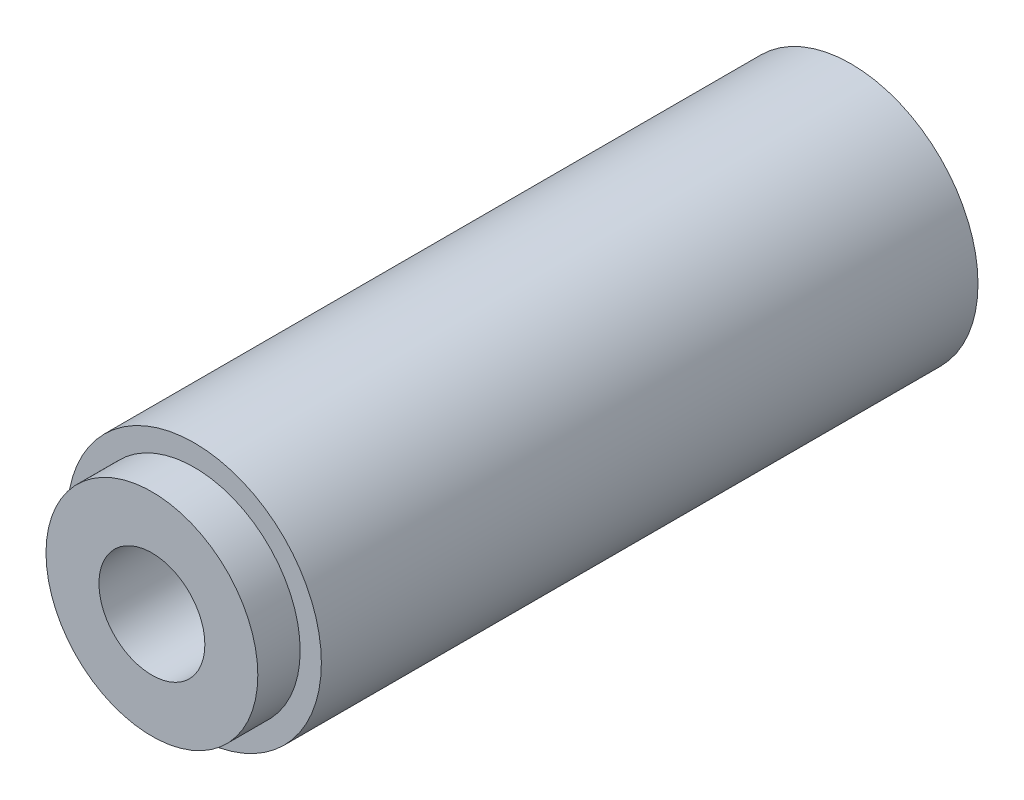
ISO-10303-21;
HEADER;
FILE_DESCRIPTION(('STEP AP214'),'2;1');
FILE_NAME('part.step','',(''),(''),'','','');
FILE_SCHEMA(('AUTOMOTIVE_DESIGN { 1 0 10303 214 1 1 1 1 }'));
ENDSEC;
DATA;
#1=APPLICATION_CONTEXT('core data for automotive mechanical design processes');
#2=APPLICATION_PROTOCOL_DEFINITION('international standard','automotive_design',2000,#1);
#3=PRODUCT_CONTEXT('',#1,'mechanical');
#4=PRODUCT('Part','Part','',(#3));
#5=PRODUCT_RELATED_PRODUCT_CATEGORY('part','',(#4));
#6=PRODUCT_DEFINITION_FORMATION('','',#4);
#7=PRODUCT_DEFINITION_CONTEXT('part definition',#1,'design');
#8=PRODUCT_DEFINITION('design','',#6,#7);
#9=PRODUCT_DEFINITION_SHAPE('','',#8);
#10=(LENGTH_UNIT() NAMED_UNIT(*) SI_UNIT(.MILLI.,.METRE.));
#11=(NAMED_UNIT(*) PLANE_ANGLE_UNIT() SI_UNIT($,.RADIAN.));
#12=(NAMED_UNIT(*) SI_UNIT($,.STERADIAN.) SOLID_ANGLE_UNIT());
#13=UNCERTAINTY_MEASURE_WITH_UNIT(LENGTH_MEASURE(1.E-05),#10,'distance_accuracy_value','');
#14=(GEOMETRIC_REPRESENTATION_CONTEXT(3) GLOBAL_UNCERTAINTY_ASSIGNED_CONTEXT((#13)) GLOBAL_UNIT_ASSIGNED_CONTEXT((#10,
#11,#12)) REPRESENTATION_CONTEXT('',''));
#15=CARTESIAN_POINT('',(0.,0.,0.));
#16=DIRECTION('',(0.,0.,1.));
#17=DIRECTION('',(1.,0.,0.));
#18=AXIS2_PLACEMENT_3D('',#15,#16,#17);
#19=CARTESIAN_POINT('',(0.,0.,31.));
#20=DIRECTION('',(0.,0.,1.));
#21=DIRECTION('',(1.,0.,0.));
#22=AXIS2_PLACEMENT_3D('',#19,#20,#21);
#23=PLANE('',#22);
#24=CARTESIAN_POINT('',(0.,0.,31.));
#25=DIRECTION('',(0.,0.,1.));
#26=DIRECTION('',(1.,0.,0.));
#27=AXIS2_PLACEMENT_3D('',#24,#25,#26);
#28=CIRCLE('',#27,6.);
#29=CARTESIAN_POINT('',(6.,0.,31.));
#30=VERTEX_POINT('',#29);
#31=EDGE_CURVE('E10',#30,#30,#28,.T.);
#32=ORIENTED_EDGE('',*,*,#31,.T.);
#33=EDGE_LOOP('',(#32));
#34=FACE_BOUND('',#33,.T.);
#35=CARTESIAN_POINT('',(0.,0.,31.));
#36=DIRECTION('',(0.,0.,1.));
#37=DIRECTION('',(1.,0.,0.));
#38=AXIS2_PLACEMENT_3D('',#35,#36,#37);
#39=CIRCLE('',#38,5.);
#40=CARTESIAN_POINT('',(5.,0.,31.));
#41=VERTEX_POINT('',#40);
#42=EDGE_CURVE('E46',#41,#41,#39,.T.);
#43=ORIENTED_EDGE('',*,*,#42,.F.);
#44=EDGE_LOOP('',(#43));
#45=FACE_BOUND('',#44,.T.);
#46=ADVANCED_FACE('F33',(#34,#45),#23,.T.);
#47=CARTESIAN_POINT('',(0.,0.,31.));
#48=DIRECTION('',(0.,0.,-1.));
#49=DIRECTION('',(-1.,0.,0.));
#50=AXIS2_PLACEMENT_3D('',#47,#48,#49);
#51=CYLINDRICAL_SURFACE('',#50,6.);
#52=ORIENTED_EDGE('',*,*,#31,.F.);
#53=EDGE_LOOP('',(#52));
#54=FACE_BOUND('',#53,.T.);
#55=CARTESIAN_POINT('',(0.,0.,0.));
#56=DIRECTION('',(0.,0.,1.));
#57=DIRECTION('',(1.,0.,0.));
#58=AXIS2_PLACEMENT_3D('',#55,#56,#57);
#59=CIRCLE('',#58,6.);
#60=CARTESIAN_POINT('',(6.,0.,0.));
#61=VERTEX_POINT('',#60);
#62=EDGE_CURVE('E37',#61,#61,#59,.T.);
#63=ORIENTED_EDGE('',*,*,#62,.T.);
#64=EDGE_LOOP('',(#63));
#65=FACE_BOUND('',#64,.T.);
#66=ADVANCED_FACE('F35',(#54,#65),#51,.T.);
#67=CARTESIAN_POINT('',(0.,0.,0.));
#68=DIRECTION('',(0.,0.,1.));
#69=DIRECTION('',(1.,0.,0.));
#70=AXIS2_PLACEMENT_3D('',#67,#68,#69);
#71=PLANE('',#70);
#72=ORIENTED_EDGE('',*,*,#62,.F.);
#73=EDGE_LOOP('',(#72));
#74=FACE_BOUND('',#73,.T.);
#75=ADVANCED_FACE('F75',(#74),#71,.F.);
#76=CARTESIAN_POINT('',(0.,0.,33.));
#77=DIRECTION('',(0.,0.,-1.));
#78=DIRECTION('',(-1.,0.,0.));
#79=AXIS2_PLACEMENT_3D('',#76,#77,#78);
#80=CYLINDRICAL_SURFACE('',#79,5.);
#81=CARTESIAN_POINT('',(0.,0.,33.));
#82=DIRECTION('',(0.,0.,1.));
#83=DIRECTION('',(1.,0.,0.));
#84=AXIS2_PLACEMENT_3D('',#81,#82,#83);
#85=CIRCLE('',#84,5.);
#86=CARTESIAN_POINT('',(5.,0.,33.));
#87=VERTEX_POINT('',#86);
#88=EDGE_CURVE('E44',#87,#87,#85,.T.);
#89=ORIENTED_EDGE('',*,*,#88,.F.);
#90=EDGE_LOOP('',(#89));
#91=FACE_BOUND('',#90,.T.);
#92=ORIENTED_EDGE('',*,*,#42,.T.);
#93=EDGE_LOOP('',(#92));
#94=FACE_BOUND('',#93,.T.);
#95=ADVANCED_FACE('F69',(#91,#94),#80,.T.);
#96=CARTESIAN_POINT('',(0.,0.,33.));
#97=DIRECTION('',(0.,0.,1.));
#98=DIRECTION('',(1.,0.,0.));
#99=AXIS2_PLACEMENT_3D('',#96,#97,#98);
#100=PLANE('',#99);
#101=CARTESIAN_POINT('',(0.,0.,33.));
#102=DIRECTION('',(0.,0.,1.));
#103=DIRECTION('',(1.,0.,0.));
#104=AXIS2_PLACEMENT_3D('',#101,#102,#103);
#105=CIRCLE('',#104,2.5);
#106=CARTESIAN_POINT('',(2.5,0.,33.));
#107=VERTEX_POINT('',#106);
#108=EDGE_CURVE('E52',#107,#107,#105,.T.);
#109=ORIENTED_EDGE('',*,*,#108,.F.);
#110=EDGE_LOOP('',(#109));
#111=FACE_BOUND('',#110,.T.);
#112=ORIENTED_EDGE('',*,*,#88,.T.);
#113=EDGE_LOOP('',(#112));
#114=FACE_BOUND('',#113,.T.);
#115=ADVANCED_FACE('F63',(#111,#114),#100,.T.);
#116=CARTESIAN_POINT('',(0.,0.,28.));
#117=DIRECTION('',(0.,0.,1.));
#118=DIRECTION('',(1.,0.,0.));
#119=AXIS2_PLACEMENT_3D('',#116,#117,#118);
#120=CYLINDRICAL_SURFACE('',#119,2.5);
#121=CARTESIAN_POINT('',(0.,0.,28.));
#122=DIRECTION('',(0.,0.,1.));
#123=DIRECTION('',(1.,0.,0.));
#124=AXIS2_PLACEMENT_3D('',#121,#122,#123);
#125=CIRCLE('',#124,2.5);
#126=CARTESIAN_POINT('',(2.5,0.,28.));
#127=VERTEX_POINT('',#126);
#128=EDGE_CURVE('E49',#127,#127,#125,.T.);
#129=ORIENTED_EDGE('',*,*,#128,.F.);
#130=EDGE_LOOP('',(#129));
#131=FACE_BOUND('',#130,.T.);
#132=ORIENTED_EDGE('',*,*,#108,.T.);
#133=EDGE_LOOP('',(#132));
#134=FACE_BOUND('',#133,.T.);
#135=ADVANCED_FACE('F60',(#131,#134),#120,.F.);
#136=CARTESIAN_POINT('',(0.,0.,28.));
#137=DIRECTION('',(0.,0.,1.));
#138=DIRECTION('',(1.,0.,0.));
#139=AXIS2_PLACEMENT_3D('',#136,#137,#138);
#140=PLANE('',#139);
#141=ORIENTED_EDGE('',*,*,#128,.T.);
#142=EDGE_LOOP('',(#141));
#143=FACE_BOUND('',#142,.T.);
#144=ADVANCED_FACE('F58',(#143),#140,.T.);
#145=CLOSED_SHELL('',(#46,#66,#75,#95,#115,#135,#144));
#146=MANIFOLD_SOLID_BREP('B2',#145);
#147=ADVANCED_BREP_SHAPE_REPRESENTATION('',(#18,#146),#14);
#148=SHAPE_DEFINITION_REPRESENTATION(#9,#147);
ENDSEC;
END-ISO-10303-21;
